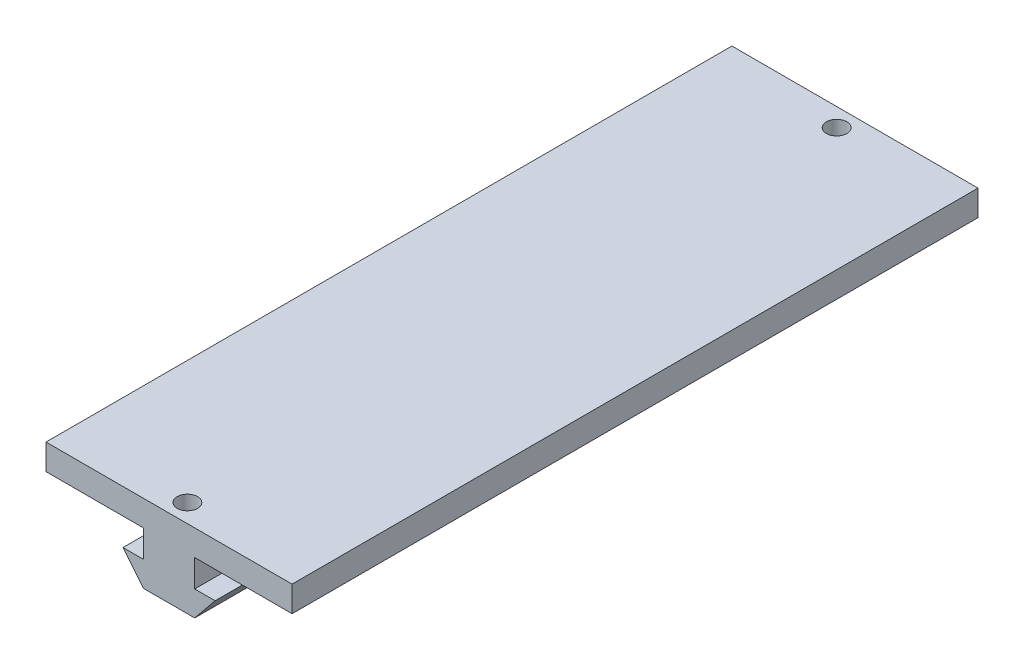
ISO-10303-21;
HEADER;
FILE_DESCRIPTION(('STEP AP214'),'2;1');
FILE_NAME('part.step','',(''),(''),'','','');
FILE_SCHEMA(('AUTOMOTIVE_DESIGN { 1 0 10303 214 1 1 1 1 }'));
ENDSEC;
DATA;
#1=APPLICATION_CONTEXT('core data for automotive mechanical design processes');
#2=APPLICATION_PROTOCOL_DEFINITION('international standard','automotive_design',2000,#1);
#3=PRODUCT_CONTEXT('',#1,'mechanical');
#4=PRODUCT('Part','Part','',(#3));
#5=PRODUCT_RELATED_PRODUCT_CATEGORY('part','',(#4));
#6=PRODUCT_DEFINITION_FORMATION('','',#4);
#7=PRODUCT_DEFINITION_CONTEXT('part definition',#1,'design');
#8=PRODUCT_DEFINITION('design','',#6,#7);
#9=PRODUCT_DEFINITION_SHAPE('','',#8);
#10=(LENGTH_UNIT() NAMED_UNIT(*) SI_UNIT(.MILLI.,.METRE.));
#11=(NAMED_UNIT(*) PLANE_ANGLE_UNIT() SI_UNIT($,.RADIAN.));
#12=(NAMED_UNIT(*) SI_UNIT($,.STERADIAN.) SOLID_ANGLE_UNIT());
#13=UNCERTAINTY_MEASURE_WITH_UNIT(LENGTH_MEASURE(1.E-05),#10,'distance_accuracy_value','');
#14=(GEOMETRIC_REPRESENTATION_CONTEXT(3) GLOBAL_UNCERTAINTY_ASSIGNED_CONTEXT((#13)) GLOBAL_UNIT_ASSIGNED_CONTEXT((#10,
#11,#12)) REPRESENTATION_CONTEXT('',''));
#15=CARTESIAN_POINT('',(0.,0.,0.));
#16=DIRECTION('',(0.,0.,1.));
#17=DIRECTION('',(1.,0.,0.));
#18=AXIS2_PLACEMENT_3D('',#15,#16,#17);
#19=CARTESIAN_POINT('',(23.5,4.9,65.5));
#20=DIRECTION('',(-1.,0.,0.));
#21=DIRECTION('',(0.,0.,1.));
#22=AXIS2_PLACEMENT_3D('',#19,#20,#21);
#23=PLANE('',#22);
#24=DIRECTION('',(0.,0.,-1.));
#25=VECTOR('',#24,1.);
#26=CARTESIAN_POINT('',(23.5,0.,65.5));
#27=LINE('',#26,#25);
#28=CARTESIAN_POINT('',(23.5,0.,65.5));
#29=VERTEX_POINT('',#28);
#30=CARTESIAN_POINT('',(23.5,0.,-65.5));
#31=VERTEX_POINT('',#30);
#32=EDGE_CURVE('E216',#29,#31,#27,.T.);
#33=ORIENTED_EDGE('',*,*,#32,.T.);
#34=DIRECTION('',(0.,-1.,0.));
#35=VECTOR('',#34,1.);
#36=CARTESIAN_POINT('',(23.5,4.9,-65.5));
#37=LINE('',#36,#35);
#38=CARTESIAN_POINT('',(23.5,4.9,-65.5));
#39=VERTEX_POINT('',#38);
#40=EDGE_CURVE('E11',#39,#31,#37,.T.);
#41=ORIENTED_EDGE('',*,*,#40,.F.);
#42=DIRECTION('',(0.,0.,-1.));
#43=VECTOR('',#42,1.);
#44=CARTESIAN_POINT('',(23.5,4.9,65.5));
#45=LINE('',#44,#43);
#46=CARTESIAN_POINT('',(23.5,4.9,65.5));
#47=VERTEX_POINT('',#46);
#48=EDGE_CURVE('E234',#47,#39,#45,.T.);
#49=ORIENTED_EDGE('',*,*,#48,.F.);
#50=DIRECTION('',(0.,-1.,0.));
#51=VECTOR('',#50,1.);
#52=CARTESIAN_POINT('',(23.5,4.9,65.5));
#53=LINE('',#52,#51);
#54=EDGE_CURVE('E245',#47,#29,#53,.T.);
#55=ORIENTED_EDGE('',*,*,#54,.T.);
#56=EDGE_LOOP('',(#33,#41,#49,#55));
#57=FACE_BOUND('',#56,.T.);
#58=ADVANCED_FACE('F42',(#57),#23,.F.);
#59=CARTESIAN_POINT('',(-23.5,4.9,-65.5));
#60=DIRECTION('',(0.,0.,1.));
#61=DIRECTION('',(1.,0.,0.));
#62=AXIS2_PLACEMENT_3D('',#59,#60,#61);
#63=PLANE('',#62);
#64=DIRECTION('',(-1.,0.,0.));
#65=VECTOR('',#64,1.);
#66=CARTESIAN_POINT('',(-23.5,0.,-65.5));
#67=LINE('',#66,#65);
#68=CARTESIAN_POINT('',(-23.5,0.,-65.5));
#69=VERTEX_POINT('',#68);
#70=EDGE_CURVE('E249',#31,#69,#67,.T.);
#71=ORIENTED_EDGE('',*,*,#70,.T.);
#72=DIRECTION('',(0.,-1.,0.));
#73=VECTOR('',#72,1.);
#74=CARTESIAN_POINT('',(-23.5,4.9,-65.5));
#75=LINE('',#74,#73);
#76=CARTESIAN_POINT('',(-23.5,4.9,-65.5));
#77=VERTEX_POINT('',#76);
#78=EDGE_CURVE('E51',#77,#69,#75,.T.);
#79=ORIENTED_EDGE('',*,*,#78,.F.);
#80=DIRECTION('',(-1.,0.,0.));
#81=VECTOR('',#80,1.);
#82=CARTESIAN_POINT('',(-23.5,4.9,-65.5));
#83=LINE('',#82,#81);
#84=EDGE_CURVE('E95',#39,#77,#83,.T.);
#85=ORIENTED_EDGE('',*,*,#84,.F.);
#86=ORIENTED_EDGE('',*,*,#40,.T.);
#87=EDGE_LOOP('',(#71,#79,#85,#86));
#88=FACE_BOUND('',#87,.T.);
#89=ADVANCED_FACE('F295',(#88),#63,.F.);
#90=CARTESIAN_POINT('',(-23.5,4.9,65.5));
#91=DIRECTION('',(1.,0.,0.));
#92=DIRECTION('',(0.,0.,-1.));
#93=AXIS2_PLACEMENT_3D('',#90,#91,#92);
#94=PLANE('',#93);
#95=DIRECTION('',(0.,0.,1.));
#96=VECTOR('',#95,1.);
#97=CARTESIAN_POINT('',(-23.5,0.,65.5));
#98=LINE('',#97,#96);
#99=CARTESIAN_POINT('',(-23.5,0.,65.5));
#100=VERTEX_POINT('',#99);
#101=EDGE_CURVE('E252',#69,#100,#98,.T.);
#102=ORIENTED_EDGE('',*,*,#101,.T.);
#103=DIRECTION('',(0.,-1.,0.));
#104=VECTOR('',#103,1.);
#105=CARTESIAN_POINT('',(-23.5,4.9,65.5));
#106=LINE('',#105,#104);
#107=CARTESIAN_POINT('',(-23.5,4.9,65.5));
#108=VERTEX_POINT('',#107);
#109=EDGE_CURVE('E260',#108,#100,#106,.T.);
#110=ORIENTED_EDGE('',*,*,#109,.F.);
#111=DIRECTION('',(0.,0.,1.));
#112=VECTOR('',#111,1.);
#113=CARTESIAN_POINT('',(-23.5,4.9,65.5));
#114=LINE('',#113,#112);
#115=EDGE_CURVE('E240',#77,#108,#114,.T.);
#116=ORIENTED_EDGE('',*,*,#115,.F.);
#117=ORIENTED_EDGE('',*,*,#78,.T.);
#118=EDGE_LOOP('',(#102,#110,#116,#117));
#119=FACE_BOUND('',#118,.T.);
#120=ADVANCED_FACE('F269',(#119),#94,.F.);
#121=CARTESIAN_POINT('',(-23.5,4.9,65.5));
#122=DIRECTION('',(0.,0.,-1.));
#123=DIRECTION('',(-1.,0.,0.));
#124=AXIS2_PLACEMENT_3D('',#121,#122,#123);
#125=PLANE('',#124);
#126=DIRECTION('',(1.,0.,0.));
#127=VECTOR('',#126,1.);
#128=CARTESIAN_POINT('',(-23.5,0.,65.5));
#129=LINE('',#128,#127);
#130=CARTESIAN_POINT('',(-4.9,0.,65.5));
#131=VERTEX_POINT('',#130);
#132=EDGE_CURVE('E237',#100,#131,#129,.T.);
#133=ORIENTED_EDGE('',*,*,#132,.T.);
#134=DIRECTION('',(0.,-1.,0.));
#135=VECTOR('',#134,1.);
#136=CARTESIAN_POINT('',(-4.9,-5.2,65.5));
#137=LINE('',#136,#135);
#138=CARTESIAN_POINT('',(-4.9,-5.2,65.5));
#139=VERTEX_POINT('',#138);
#140=EDGE_CURVE('E58',#131,#139,#137,.T.);
#141=ORIENTED_EDGE('',*,*,#140,.T.);
#142=DIRECTION('',(-1.,0.,0.));
#143=VECTOR('',#142,1.);
#144=CARTESIAN_POINT('',(-8.8,-5.2,65.5));
#145=LINE('',#144,#143);
#146=CARTESIAN_POINT('',(-8.8,-5.2,65.5));
#147=VERTEX_POINT('',#146);
#148=EDGE_CURVE('E146',#139,#147,#145,.T.);
#149=ORIENTED_EDGE('',*,*,#148,.T.);
#150=DIRECTION('',(0.630592625094466,-0.776114000116266,0.));
#151=VECTOR('',#150,1.);
#152=CARTESIAN_POINT('',(-4.9,-10.,65.5));
#153=LINE('',#152,#151);
#154=CARTESIAN_POINT('',(-4.9,-10.,65.5));
#155=VERTEX_POINT('',#154);
#156=EDGE_CURVE('E199',#147,#155,#153,.T.);
#157=ORIENTED_EDGE('',*,*,#156,.T.);
#158=DIRECTION('',(1.,0.,0.));
#159=VECTOR('',#158,1.);
#160=CARTESIAN_POINT('',(4.9,-10.,65.5));
#161=LINE('',#160,#159);
#162=CARTESIAN_POINT('',(4.9,-10.,65.5));
#163=VERTEX_POINT('',#162);
#164=EDGE_CURVE('E203',#155,#163,#161,.T.);
#165=ORIENTED_EDGE('',*,*,#164,.T.);
#166=DIRECTION('',(0.630592625094466,0.776114000116266,0.));
#167=VECTOR('',#166,1.);
#168=CARTESIAN_POINT('',(8.8,-5.2,65.5));
#169=LINE('',#168,#167);
#170=CARTESIAN_POINT('',(8.8,-5.2,65.5));
#171=VERTEX_POINT('',#170);
#172=EDGE_CURVE('E207',#163,#171,#169,.T.);
#173=ORIENTED_EDGE('',*,*,#172,.T.);
#174=DIRECTION('',(-1.,0.,0.));
#175=VECTOR('',#174,1.);
#176=CARTESIAN_POINT('',(4.9,-5.2,65.5));
#177=LINE('',#176,#175);
#178=CARTESIAN_POINT('',(4.9,-5.2,65.5));
#179=VERTEX_POINT('',#178);
#180=EDGE_CURVE('E170',#171,#179,#177,.T.);
#181=ORIENTED_EDGE('',*,*,#180,.T.);
#182=DIRECTION('',(0.,1.,0.));
#183=VECTOR('',#182,1.);
#184=CARTESIAN_POINT('',(4.9,0.,65.5));
#185=LINE('',#184,#183);
#186=CARTESIAN_POINT('',(4.9,0.,65.5));
#187=VERTEX_POINT('',#186);
#188=EDGE_CURVE('E167',#179,#187,#185,.T.);
#189=ORIENTED_EDGE('',*,*,#188,.T.);
#190=EDGE_CURVE('E88',#187,#29,#129,.T.);
#191=ORIENTED_EDGE('',*,*,#190,.T.);
#192=ORIENTED_EDGE('',*,*,#54,.F.);
#193=DIRECTION('',(1.,0.,0.));
#194=VECTOR('',#193,1.);
#195=CARTESIAN_POINT('',(-23.5,4.9,65.5));
#196=LINE('',#195,#194);
#197=EDGE_CURVE('E67',#108,#47,#196,.T.);
#198=ORIENTED_EDGE('',*,*,#197,.F.);
#199=ORIENTED_EDGE('',*,*,#109,.T.);
#200=EDGE_LOOP('',(#133,#141,#149,#157,#165,#173,#181,#189,#191,#192,#198,#199));
#201=FACE_BOUND('',#200,.T.);
#202=ADVANCED_FACE('F276',(#201),#125,.F.);
#203=CARTESIAN_POINT('',(0.,4.9,0.));
#204=DIRECTION('',(0.,-1.,0.));
#205=DIRECTION('',(0.,0.,-1.));
#206=AXIS2_PLACEMENT_3D('',#203,#204,#205);
#207=PLANE('',#206);
#208=CARTESIAN_POINT('',(0.,4.9,-62.));
#209=DIRECTION('',(0.,1.,0.));
#210=DIRECTION('',(0.,0.,1.));
#211=AXIS2_PLACEMENT_3D('',#208,#209,#210);
#212=CIRCLE('',#211,1.95);
#213=CARTESIAN_POINT('',(0.,4.9,-60.05));
#214=VERTEX_POINT('',#213);
#215=EDGE_CURVE('E488',#214,#214,#212,.T.);
#216=ORIENTED_EDGE('',*,*,#215,.F.);
#217=EDGE_LOOP('',(#216));
#218=FACE_BOUND('',#217,.T.);
#219=CARTESIAN_POINT('',(0.,4.9,62.));
#220=DIRECTION('',(0.,1.,0.));
#221=DIRECTION('',(0.,0.,1.));
#222=AXIS2_PLACEMENT_3D('',#219,#220,#221);
#223=CIRCLE('',#222,1.95);
#224=CARTESIAN_POINT('',(0.,4.9,63.95));
#225=VERTEX_POINT('',#224);
#226=EDGE_CURVE('E485',#225,#225,#223,.T.);
#227=ORIENTED_EDGE('',*,*,#226,.F.);
#228=EDGE_LOOP('',(#227));
#229=FACE_BOUND('',#228,.T.);
#230=ORIENTED_EDGE('',*,*,#48,.T.);
#231=ORIENTED_EDGE('',*,*,#84,.T.);
#232=ORIENTED_EDGE('',*,*,#115,.T.);
#233=ORIENTED_EDGE('',*,*,#197,.T.);
#234=EDGE_LOOP('',(#230,#231,#232,#233));
#235=FACE_BOUND('',#234,.T.);
#236=ADVANCED_FACE('F280',(#218,#229,#235),#207,.F.);
#237=CARTESIAN_POINT('',(0.,0.,0.));
#238=DIRECTION('',(0.,-1.,0.));
#239=DIRECTION('',(0.,0.,-1.));
#240=AXIS2_PLACEMENT_3D('',#237,#238,#239);
#241=PLANE('',#240);
#242=CARTESIAN_POINT('',(0.,0.,-62.));
#243=DIRECTION('',(0.,-1.,0.));
#244=DIRECTION('',(0.,0.,-1.));
#245=AXIS2_PLACEMENT_3D('',#242,#243,#244);
#246=CIRCLE('',#245,1.95);
#247=CARTESIAN_POINT('',(0.,0.,-63.95));
#248=VERTEX_POINT('',#247);
#249=EDGE_CURVE('E45',#248,#248,#246,.T.);
#250=ORIENTED_EDGE('',*,*,#249,.F.);
#251=EDGE_LOOP('',(#250));
#252=FACE_BOUND('',#251,.T.);
#253=DIRECTION('',(0.,0.,1.));
#254=VECTOR('',#253,1.);
#255=CARTESIAN_POINT('',(4.9,0.,15.5));
#256=LINE('',#255,#254);
#257=CARTESIAN_POINT('',(4.9,0.,15.5));
#258=VERTEX_POINT('',#257);
#259=EDGE_CURVE('E217',#258,#187,#256,.T.);
#260=ORIENTED_EDGE('',*,*,#259,.F.);
#261=DIRECTION('',(-1.,0.,0.));
#262=VECTOR('',#261,1.);
#263=CARTESIAN_POINT('',(-4.9,0.,15.5));
#264=LINE('',#263,#262);
#265=CARTESIAN_POINT('',(-4.9,0.,15.5));
#266=VERTEX_POINT('',#265);
#267=EDGE_CURVE('E150',#258,#266,#264,.T.);
#268=ORIENTED_EDGE('',*,*,#267,.T.);
#269=DIRECTION('',(0.,0.,1.));
#270=VECTOR('',#269,1.);
#271=CARTESIAN_POINT('',(-4.9,0.,15.5));
#272=LINE('',#271,#270);
#273=EDGE_CURVE('E165',#266,#131,#272,.T.);
#274=ORIENTED_EDGE('',*,*,#273,.T.);
#275=ORIENTED_EDGE('',*,*,#132,.F.);
#276=ORIENTED_EDGE('',*,*,#101,.F.);
#277=ORIENTED_EDGE('',*,*,#70,.F.);
#278=ORIENTED_EDGE('',*,*,#32,.F.);
#279=ORIENTED_EDGE('',*,*,#190,.F.);
#280=EDGE_LOOP('',(#260,#268,#274,#275,#276,#277,#278,#279));
#281=FACE_BOUND('',#280,.T.);
#282=ADVANCED_FACE('F274',(#252,#281),#241,.T.);
#283=CARTESIAN_POINT('',(-4.9,-5.2,15.5));
#284=DIRECTION('',(-1.,0.,0.));
#285=DIRECTION('',(0.,0.,1.));
#286=AXIS2_PLACEMENT_3D('',#283,#284,#285);
#287=PLANE('',#286);
#288=ORIENTED_EDGE('',*,*,#140,.F.);
#289=ORIENTED_EDGE('',*,*,#273,.F.);
#290=DIRECTION('',(0.,-1.,0.));
#291=VECTOR('',#290,1.);
#292=CARTESIAN_POINT('',(-4.9,-5.2,15.5));
#293=LINE('',#292,#291);
#294=CARTESIAN_POINT('',(-4.9,-5.2,15.5));
#295=VERTEX_POINT('',#294);
#296=EDGE_CURVE('E157',#266,#295,#293,.T.);
#297=ORIENTED_EDGE('',*,*,#296,.T.);
#298=DIRECTION('',(0.,0.,1.));
#299=VECTOR('',#298,1.);
#300=CARTESIAN_POINT('',(-4.9,-5.2,15.5));
#301=LINE('',#300,#299);
#302=EDGE_CURVE('E141',#295,#139,#301,.T.);
#303=ORIENTED_EDGE('',*,*,#302,.T.);
#304=EDGE_LOOP('',(#288,#289,#297,#303));
#305=FACE_BOUND('',#304,.T.);
#306=ADVANCED_FACE('F164',(#305),#287,.T.);
#307=CARTESIAN_POINT('',(4.9,0.,15.5));
#308=DIRECTION('',(1.,0.,0.));
#309=DIRECTION('',(0.,0.,-1.));
#310=AXIS2_PLACEMENT_3D('',#307,#308,#309);
#311=PLANE('',#310);
#312=ORIENTED_EDGE('',*,*,#188,.F.);
#313=DIRECTION('',(0.,0.,1.));
#314=VECTOR('',#313,1.);
#315=CARTESIAN_POINT('',(4.9,-5.2,15.5));
#316=LINE('',#315,#314);
#317=CARTESIAN_POINT('',(4.9,-5.2,15.5));
#318=VERTEX_POINT('',#317);
#319=EDGE_CURVE('E220',#318,#179,#316,.T.);
#320=ORIENTED_EDGE('',*,*,#319,.F.);
#321=DIRECTION('',(0.,1.,0.));
#322=VECTOR('',#321,1.);
#323=CARTESIAN_POINT('',(4.9,0.,15.5));
#324=LINE('',#323,#322);
#325=EDGE_CURVE('E190',#318,#258,#324,.T.);
#326=ORIENTED_EDGE('',*,*,#325,.T.);
#327=ORIENTED_EDGE('',*,*,#259,.T.);
#328=EDGE_LOOP('',(#312,#320,#326,#327));
#329=FACE_BOUND('',#328,.T.);
#330=ADVANCED_FACE('F306',(#329),#311,.T.);
#331=CARTESIAN_POINT('',(4.9,-5.2,15.5));
#332=DIRECTION('',(0.,1.,0.));
#333=DIRECTION('',(-1.,0.,0.));
#334=AXIS2_PLACEMENT_3D('',#331,#332,#333);
#335=PLANE('',#334);
#336=ORIENTED_EDGE('',*,*,#180,.F.);
#337=DIRECTION('',(0.,0.,1.));
#338=VECTOR('',#337,1.);
#339=CARTESIAN_POINT('',(8.8,-5.2,15.5));
#340=LINE('',#339,#338);
#341=CARTESIAN_POINT('',(8.8,-5.2,15.5));
#342=VERTEX_POINT('',#341);
#343=EDGE_CURVE('E223',#342,#171,#340,.T.);
#344=ORIENTED_EDGE('',*,*,#343,.F.);
#345=DIRECTION('',(-1.,0.,0.));
#346=VECTOR('',#345,1.);
#347=CARTESIAN_POINT('',(4.9,-5.2,15.5));
#348=LINE('',#347,#346);
#349=EDGE_CURVE('E186',#342,#318,#348,.T.);
#350=ORIENTED_EDGE('',*,*,#349,.T.);
#351=ORIENTED_EDGE('',*,*,#319,.T.);
#352=EDGE_LOOP('',(#336,#344,#350,#351));
#353=FACE_BOUND('',#352,.T.);
#354=ADVANCED_FACE('F311',(#353),#335,.T.);
#355=CARTESIAN_POINT('',(8.8,-5.2,15.5));
#356=DIRECTION('',(0.776114000116266,-0.630592625094466,0.));
#357=DIRECTION('',(0.630592625094466,0.776114000116265,0.));
#358=AXIS2_PLACEMENT_3D('',#355,#356,#357);
#359=PLANE('',#358);
#360=ORIENTED_EDGE('',*,*,#172,.F.);
#361=DIRECTION('',(0.,0.,1.));
#362=VECTOR('',#361,1.);
#363=CARTESIAN_POINT('',(4.9,-10.,15.5));
#364=LINE('',#363,#362);
#365=CARTESIAN_POINT('',(4.9,-10.,15.5));
#366=VERTEX_POINT('',#365);
#367=EDGE_CURVE('E226',#366,#163,#364,.T.);
#368=ORIENTED_EDGE('',*,*,#367,.F.);
#369=DIRECTION('',(0.630592625094466,0.776114000116266,0.));
#370=VECTOR('',#369,1.);
#371=CARTESIAN_POINT('',(8.8,-5.2,15.5));
#372=LINE('',#371,#370);
#373=EDGE_CURVE('E182',#366,#342,#372,.T.);
#374=ORIENTED_EDGE('',*,*,#373,.T.);
#375=ORIENTED_EDGE('',*,*,#343,.T.);
#376=EDGE_LOOP('',(#360,#368,#374,#375));
#377=FACE_BOUND('',#376,.T.);
#378=ADVANCED_FACE('F315',(#377),#359,.T.);
#379=CARTESIAN_POINT('',(4.9,-10.,15.5));
#380=DIRECTION('',(0.,-1.,0.));
#381=DIRECTION('',(1.,0.,0.));
#382=AXIS2_PLACEMENT_3D('',#379,#380,#381);
#383=PLANE('',#382);
#384=ORIENTED_EDGE('',*,*,#164,.F.);
#385=DIRECTION('',(0.,0.,1.));
#386=VECTOR('',#385,1.);
#387=CARTESIAN_POINT('',(-4.9,-10.,15.5));
#388=LINE('',#387,#386);
#389=CARTESIAN_POINT('',(-4.9,-10.,15.5));
#390=VERTEX_POINT('',#389);
#391=EDGE_CURVE('E229',#390,#155,#388,.T.);
#392=ORIENTED_EDGE('',*,*,#391,.F.);
#393=DIRECTION('',(1.,0.,0.));
#394=VECTOR('',#393,1.);
#395=CARTESIAN_POINT('',(4.9,-10.,15.5));
#396=LINE('',#395,#394);
#397=EDGE_CURVE('E178',#390,#366,#396,.T.);
#398=ORIENTED_EDGE('',*,*,#397,.T.);
#399=ORIENTED_EDGE('',*,*,#367,.T.);
#400=EDGE_LOOP('',(#384,#392,#398,#399));
#401=FACE_BOUND('',#400,.T.);
#402=ADVANCED_FACE('F318',(#401),#383,.T.);
#403=CARTESIAN_POINT('',(-4.9,-10.,15.5));
#404=DIRECTION('',(-0.776114000116266,-0.630592625094466,0.));
#405=DIRECTION('',(0.630592625094466,-0.776114000116265,0.));
#406=AXIS2_PLACEMENT_3D('',#403,#404,#405);
#407=PLANE('',#406);
#408=ORIENTED_EDGE('',*,*,#156,.F.);
#409=DIRECTION('',(0.,0.,1.));
#410=VECTOR('',#409,1.);
#411=CARTESIAN_POINT('',(-8.8,-5.2,15.5));
#412=LINE('',#411,#410);
#413=CARTESIAN_POINT('',(-8.8,-5.2,15.5));
#414=VERTEX_POINT('',#413);
#415=EDGE_CURVE('E149',#414,#147,#412,.T.);
#416=ORIENTED_EDGE('',*,*,#415,.F.);
#417=DIRECTION('',(0.630592625094466,-0.776114000116266,0.));
#418=VECTOR('',#417,1.);
#419=CARTESIAN_POINT('',(-4.9,-10.,15.5));
#420=LINE('',#419,#418);
#421=EDGE_CURVE('E161',#414,#390,#420,.T.);
#422=ORIENTED_EDGE('',*,*,#421,.T.);
#423=ORIENTED_EDGE('',*,*,#391,.T.);
#424=EDGE_LOOP('',(#408,#416,#422,#423));
#425=FACE_BOUND('',#424,.T.);
#426=ADVANCED_FACE('F321',(#425),#407,.T.);
#427=CARTESIAN_POINT('',(-8.8,-5.2,15.5));
#428=DIRECTION('',(0.,1.,0.));
#429=DIRECTION('',(0.,0.,1.));
#430=AXIS2_PLACEMENT_3D('',#427,#428,#429);
#431=PLANE('',#430);
#432=ORIENTED_EDGE('',*,*,#148,.F.);
#433=ORIENTED_EDGE('',*,*,#302,.F.);
#434=DIRECTION('',(-1.,0.,0.));
#435=VECTOR('',#434,1.);
#436=CARTESIAN_POINT('',(-8.8,-5.2,15.5));
#437=LINE('',#436,#435);
#438=EDGE_CURVE('E144',#295,#414,#437,.T.);
#439=ORIENTED_EDGE('',*,*,#438,.T.);
#440=ORIENTED_EDGE('',*,*,#415,.T.);
#441=EDGE_LOOP('',(#432,#433,#439,#440));
#442=FACE_BOUND('',#441,.T.);
#443=ADVANCED_FACE('F143',(#442),#431,.T.);
#444=CARTESIAN_POINT('',(0.,0.,15.5));
#445=DIRECTION('',(0.,0.,-1.));
#446=DIRECTION('',(-1.,0.,0.));
#447=AXIS2_PLACEMENT_3D('',#444,#445,#446);
#448=PLANE('',#447);
#449=ORIENTED_EDGE('',*,*,#296,.F.);
#450=ORIENTED_EDGE('',*,*,#267,.F.);
#451=ORIENTED_EDGE('',*,*,#325,.F.);
#452=ORIENTED_EDGE('',*,*,#349,.F.);
#453=ORIENTED_EDGE('',*,*,#373,.F.);
#454=ORIENTED_EDGE('',*,*,#397,.F.);
#455=ORIENTED_EDGE('',*,*,#421,.F.);
#456=ORIENTED_EDGE('',*,*,#438,.F.);
#457=EDGE_LOOP('',(#449,#450,#451,#452,#453,#454,#455,#456));
#458=FACE_BOUND('',#457,.T.);
#459=ADVANCED_FACE('F155',(#458),#448,.T.);
#460=CARTESIAN_POINT('',(0.,-1.1,-62.));
#461=DIRECTION('',(0.,1.,0.));
#462=DIRECTION('',(0.,0.,1.));
#463=AXIS2_PLACEMENT_3D('',#460,#461,#462);
#464=CYLINDRICAL_SURFACE('',#463,1.95);
#465=ORIENTED_EDGE('',*,*,#249,.T.);
#466=EDGE_LOOP('',(#465));
#467=FACE_BOUND('',#466,.T.);
#468=ORIENTED_EDGE('',*,*,#215,.T.);
#469=EDGE_LOOP('',(#468));
#470=FACE_BOUND('',#469,.T.);
#471=ADVANCED_FACE('F372',(#467,#470),#464,.F.);
#472=CARTESIAN_POINT('',(0.,-1.1,62.));
#473=DIRECTION('',(0.,1.,0.));
#474=DIRECTION('',(0.,0.,1.));
#475=AXIS2_PLACEMENT_3D('',#472,#473,#474);
#476=CYLINDRICAL_SURFACE('',#475,1.95);
#477=CARTESIAN_POINT('',(0.,-1.1,62.));
#478=DIRECTION('',(0.,1.,0.));
#479=DIRECTION('',(0.,0.,1.));
#480=AXIS2_PLACEMENT_3D('',#477,#478,#479);
#481=CIRCLE('',#480,1.95);
#482=CARTESIAN_POINT('',(0.,-1.1,63.95));
#483=VERTEX_POINT('',#482);
#484=EDGE_CURVE('E173',#483,#483,#481,.T.);
#485=ORIENTED_EDGE('',*,*,#484,.F.);
#486=EDGE_LOOP('',(#485));
#487=FACE_BOUND('',#486,.T.);
#488=ORIENTED_EDGE('',*,*,#226,.T.);
#489=EDGE_LOOP('',(#488));
#490=FACE_BOUND('',#489,.T.);
#491=ADVANCED_FACE('F396',(#487,#490),#476,.F.);
#492=CARTESIAN_POINT('',(0.,-1.1,62.));
#493=DIRECTION('',(0.,1.,0.));
#494=DIRECTION('',(0.,0.,1.));
#495=AXIS2_PLACEMENT_3D('',#492,#493,#494);
#496=PLANE('',#495);
#497=ORIENTED_EDGE('',*,*,#484,.T.);
#498=EDGE_LOOP('',(#497));
#499=FACE_BOUND('',#498,.T.);
#500=ADVANCED_FACE('F407',(#499),#496,.T.);
#501=CLOSED_SHELL('',(#58,#89,#120,#202,#236,#282,#306,#330,#354,#378,#402,#426,#443,#459,#471,
#491,#500));
#502=MANIFOLD_SOLID_BREP('B2',#501);
#503=ADVANCED_BREP_SHAPE_REPRESENTATION('',(#18,#502),#14);
#504=SHAPE_DEFINITION_REPRESENTATION(#9,#503);
ENDSEC;
END-ISO-10303-21;
